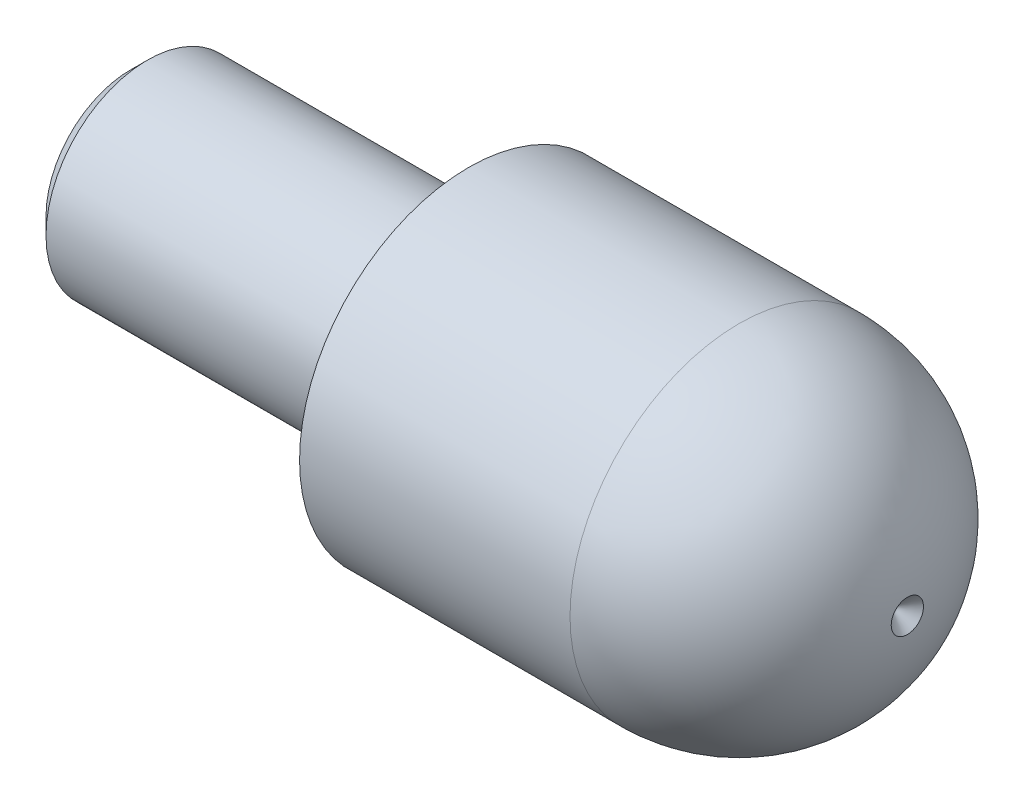
ISO-10303-21;
HEADER;
FILE_DESCRIPTION(('STEP AP214'),'2;1');
FILE_NAME('part.step','',(''),(''),'','','');
FILE_SCHEMA(('AUTOMOTIVE_DESIGN { 1 0 10303 214 1 1 1 1 }'));
ENDSEC;
DATA;
#1=APPLICATION_CONTEXT('core data for automotive mechanical design processes');
#2=APPLICATION_PROTOCOL_DEFINITION('international standard','automotive_design',2000,#1);
#3=PRODUCT_CONTEXT('',#1,'mechanical');
#4=PRODUCT('Part','Part','',(#3));
#5=PRODUCT_RELATED_PRODUCT_CATEGORY('part','',(#4));
#6=PRODUCT_DEFINITION_FORMATION('','',#4);
#7=PRODUCT_DEFINITION_CONTEXT('part definition',#1,'design');
#8=PRODUCT_DEFINITION('design','',#6,#7);
#9=PRODUCT_DEFINITION_SHAPE('','',#8);
#10=(LENGTH_UNIT() NAMED_UNIT(*) SI_UNIT(.MILLI.,.METRE.));
#11=(NAMED_UNIT(*) PLANE_ANGLE_UNIT() SI_UNIT($,.RADIAN.));
#12=(NAMED_UNIT(*) SI_UNIT($,.STERADIAN.) SOLID_ANGLE_UNIT());
#13=UNCERTAINTY_MEASURE_WITH_UNIT(LENGTH_MEASURE(1.E-05),#10,'distance_accuracy_value','');
#14=(GEOMETRIC_REPRESENTATION_CONTEXT(3) GLOBAL_UNCERTAINTY_ASSIGNED_CONTEXT((#13)) GLOBAL_UNIT_ASSIGNED_CONTEXT((#10,
#11,#12)) REPRESENTATION_CONTEXT('',''));
#15=CARTESIAN_POINT('',(0.,0.,0.));
#16=DIRECTION('',(0.,0.,1.));
#17=DIRECTION('',(1.,0.,0.));
#18=AXIS2_PLACEMENT_3D('',#15,#16,#17);
#19=CARTESIAN_POINT('',(-9.7295,0.,0.));
#20=DIRECTION('',(-1.,0.,0.));
#21=DIRECTION('',(0.,0.,1.));
#22=AXIS2_PLACEMENT_3D('',#19,#20,#21);
#23=CONICAL_SURFACE('',#22,1.2295,0.785398163397449);
#24=CARTESIAN_POINT('',(-10.,0.,0.));
#25=DIRECTION('',(-1.,0.,0.));
#26=DIRECTION('',(0.,0.,1.));
#27=AXIS2_PLACEMENT_3D('',#24,#25,#26);
#28=CIRCLE('',#27,1.5);
#29=CARTESIAN_POINT('',(-10.,0.,1.5));
#30=VERTEX_POINT('',#29);
#31=EDGE_CURVE('E70',#30,#30,#28,.T.);
#32=ORIENTED_EDGE('',*,*,#31,.T.);
#33=EDGE_LOOP('',(#32));
#34=FACE_BOUND('',#33,.T.);
#35=CARTESIAN_POINT('',(-9.8,0.,0.));
#36=DIRECTION('',(-1.,0.,0.));
#37=DIRECTION('',(0.,0.,1.));
#38=AXIS2_PLACEMENT_3D('',#35,#36,#37);
#39=CIRCLE('',#38,1.3);
#40=CARTESIAN_POINT('',(-9.8,0.,1.3));
#41=VERTEX_POINT('',#40);
#42=EDGE_CURVE('E35',#41,#41,#39,.F.);
#43=ORIENTED_EDGE('',*,*,#42,.T.);
#44=EDGE_LOOP('',(#43));
#45=FACE_BOUND('',#44,.T.);
#46=ADVANCED_FACE('F31',(#34,#45),#23,.F.);
#47=CARTESIAN_POINT('',(0.1,0.,0.));
#48=DIRECTION('',(-1.,0.,0.));
#49=DIRECTION('',(0.,0.,1.));
#50=AXIS2_PLACEMENT_3D('',#47,#48,#49);
#51=CYLINDRICAL_SURFACE('',#50,3.);
#52=CARTESIAN_POINT('',(-9.5,0.,0.));
#53=DIRECTION('',(-1.,0.,0.));
#54=DIRECTION('',(0.,0.,1.));
#55=AXIS2_PLACEMENT_3D('',#52,#53,#54);
#56=CIRCLE('',#55,3.);
#57=CARTESIAN_POINT('',(-9.5,0.,3.));
#58=VERTEX_POINT('',#57);
#59=EDGE_CURVE('E40',#58,#58,#56,.T.);
#60=ORIENTED_EDGE('',*,*,#59,.F.);
#61=EDGE_LOOP('',(#60));
#62=FACE_BOUND('',#61,.T.);
#63=CARTESIAN_POINT('',(-1.,0.,0.));
#64=DIRECTION('',(-1.,0.,0.));
#65=DIRECTION('',(0.,0.,1.));
#66=AXIS2_PLACEMENT_3D('',#63,#64,#65);
#67=CIRCLE('',#66,3.);
#68=CARTESIAN_POINT('',(-1.,0.,3.));
#69=VERTEX_POINT('',#68);
#70=EDGE_CURVE('E57',#69,#69,#67,.T.);
#71=ORIENTED_EDGE('',*,*,#70,.T.);
#72=EDGE_LOOP('',(#71));
#73=FACE_BOUND('',#72,.T.);
#74=ADVANCED_FACE('F87',(#62,#73),#51,.T.);
#75=CARTESIAN_POINT('',(-10.,0.6,0.));
#76=DIRECTION('',(1.,0.,0.));
#77=DIRECTION('',(0.,0.,-1.));
#78=AXIS2_PLACEMENT_3D('',#75,#76,#77);
#79=PLANE('',#78);
#80=CARTESIAN_POINT('',(-10.,0.,0.));
#81=DIRECTION('',(-1.,0.,0.));
#82=DIRECTION('',(0.,0.,1.));
#83=AXIS2_PLACEMENT_3D('',#80,#81,#82);
#84=CIRCLE('',#83,2.5);
#85=CARTESIAN_POINT('',(-10.,0.,2.5));
#86=VERTEX_POINT('',#85);
#87=EDGE_CURVE('E11',#86,#86,#84,.T.);
#88=ORIENTED_EDGE('',*,*,#87,.T.);
#89=EDGE_LOOP('',(#88));
#90=FACE_BOUND('',#89,.T.);
#91=ORIENTED_EDGE('',*,*,#31,.F.);
#92=EDGE_LOOP('',(#91));
#93=FACE_BOUND('',#92,.T.);
#94=ADVANCED_FACE('F33',(#90,#93),#79,.F.);
#95=CARTESIAN_POINT('',(-9.5,0.,0.));
#96=DIRECTION('',(1.,0.,0.));
#97=DIRECTION('',(0.,0.,-1.));
#98=AXIS2_PLACEMENT_3D('',#95,#96,#97);
#99=CONICAL_SURFACE('',#98,3.,0.785398163397448);
#100=ORIENTED_EDGE('',*,*,#87,.F.);
#101=EDGE_LOOP('',(#100));
#102=FACE_BOUND('',#101,.T.);
#103=ORIENTED_EDGE('',*,*,#59,.T.);
#104=EDGE_LOOP('',(#103));
#105=FACE_BOUND('',#104,.T.);
#106=ADVANCED_FACE('F85',(#102,#105),#99,.T.);
#107=CARTESIAN_POINT('',(-0.826794919243148,0.,0.));
#108=DIRECTION('',(-1.,0.,0.));
#109=DIRECTION('',(0.,0.,1.));
#110=AXIS2_PLACEMENT_3D('',#107,#108,#109);
#111=TOROIDAL_SURFACE('',#110,3.09999999999994,0.199999999999939);
#112=CARTESIAN_POINT('',(-0.82679491924312,0.,0.));
#113=DIRECTION('',(-1.,0.,0.));
#114=DIRECTION('',(0.,0.,1.));
#115=AXIS2_PLACEMENT_3D('',#112,#113,#114);
#116=CIRCLE('',#115,2.9);
#117=CARTESIAN_POINT('',(-0.82679491924312,0.,2.9));
#118=VERTEX_POINT('',#117);
#119=EDGE_CURVE('E67',#118,#118,#116,.T.);
#120=ORIENTED_EDGE('',*,*,#119,.T.);
#121=EDGE_LOOP('',(#120));
#122=FACE_BOUND('',#121,.T.);
#123=ORIENTED_EDGE('',*,*,#70,.F.);
#124=EDGE_LOOP('',(#123));
#125=FACE_BOUND('',#124,.T.);
#126=ADVANCED_FACE('F93',(#122,#125),#111,.F.);
#127=CARTESIAN_POINT('',(0.,0.,0.));
#128=DIRECTION('',(-1.,0.,0.));
#129=DIRECTION('',(0.,0.,1.));
#130=AXIS2_PLACEMENT_3D('',#127,#128,#129);
#131=CYLINDRICAL_SURFACE('',#130,2.9);
#132=CARTESIAN_POINT('',(-0.17320508075688,0.,0.));
#133=DIRECTION('',(-1.,0.,0.));
#134=DIRECTION('',(0.,0.,1.));
#135=AXIS2_PLACEMENT_3D('',#132,#133,#134);
#136=CIRCLE('',#135,2.9);
#137=CARTESIAN_POINT('',(-0.17320508075688,0.,2.9));
#138=VERTEX_POINT('',#137);
#139=EDGE_CURVE('E64',#138,#138,#136,.T.);
#140=ORIENTED_EDGE('',*,*,#139,.T.);
#141=EDGE_LOOP('',(#140));
#142=FACE_BOUND('',#141,.T.);
#143=ORIENTED_EDGE('',*,*,#119,.F.);
#144=EDGE_LOOP('',(#143));
#145=FACE_BOUND('',#144,.T.);
#146=ADVANCED_FACE('F95',(#142,#145),#131,.T.);
#147=CARTESIAN_POINT('',(-0.173205080756848,0.,0.));
#148=DIRECTION('',(-1.,0.,0.));
#149=DIRECTION('',(0.,0.,1.));
#150=AXIS2_PLACEMENT_3D('',#147,#148,#149);
#151=TOROIDAL_SURFACE('',#150,3.09999999999993,0.199999999999931);
#152=CARTESIAN_POINT('',(0.,0.,0.));
#153=DIRECTION('',(-1.,0.,0.));
#154=DIRECTION('',(0.,0.,1.));
#155=AXIS2_PLACEMENT_3D('',#152,#153,#154);
#156=CIRCLE('',#155,3.);
#157=CARTESIAN_POINT('',(0.,0.,3.));
#158=VERTEX_POINT('',#157);
#159=EDGE_CURVE('E61',#158,#158,#156,.T.);
#160=ORIENTED_EDGE('',*,*,#159,.T.);
#161=EDGE_LOOP('',(#160));
#162=FACE_BOUND('',#161,.T.);
#163=ORIENTED_EDGE('',*,*,#139,.F.);
#164=EDGE_LOOP('',(#163));
#165=FACE_BOUND('',#164,.T.);
#166=ADVANCED_FACE('F102',(#162,#165),#151,.F.);
#167=CARTESIAN_POINT('',(12.5,0.,0.));
#168=DIRECTION('',(1.,0.,0.));
#169=DIRECTION('',(0.,0.,-1.));
#170=AXIS2_PLACEMENT_3D('',#167,#168,#169);
#171=CONICAL_SURFACE('',#170,0.,0.785398163397377);
#172=CARTESIAN_POINT('',(12.977178028659,0.,0.));
#173=DIRECTION('',(-1.,0.,0.));
#174=DIRECTION('',(0.,0.,1.));
#175=AXIS2_PLACEMENT_3D('',#172,#173,#174);
#176=CIRCLE('',#175,0.477178028658931);
#177=CARTESIAN_POINT('',(12.977178028659,0.,0.477178028658931));
#178=VERTEX_POINT('',#177);
#179=EDGE_CURVE('E73',#178,#178,#176,.T.);
#180=ORIENTED_EDGE('',*,*,#179,.F.);
#181=EDGE_LOOP('',(#180));
#182=FACE_BOUND('',#181,.T.);
#183=CARTESIAN_POINT('',(12.5,0.,0.));
#184=VERTEX_POINT('',#183);
#185=VERTEX_LOOP('',#184);
#186=FACE_BOUND('',#185,.T.);
#187=ADVANCED_FACE('F113',(#182,#186),#171,.F.);
#188=CARTESIAN_POINT('',(7.99999999999976,-3.40439482160448E-13,0.));
#189=DIRECTION('',(-1.,0.,0.));
#190=DIRECTION('',(0.,1.,0.));
#191=AXIS2_PLACEMENT_3D('',#188,#189,#190);
#192=SPHERICAL_SURFACE('',#191,5.00000000000034);
#193=CARTESIAN_POINT('',(8.,0.,0.));
#194=DIRECTION('',(-1.,0.,0.));
#195=DIRECTION('',(0.,0.,1.));
#196=AXIS2_PLACEMENT_3D('',#193,#194,#195);
#197=CIRCLE('',#196,5.);
#198=CARTESIAN_POINT('',(8.,0.,5.));
#199=VERTEX_POINT('',#198);
#200=EDGE_CURVE('E76',#199,#199,#197,.T.);
#201=ORIENTED_EDGE('',*,*,#200,.F.);
#202=EDGE_LOOP('',(#201));
#203=FACE_BOUND('',#202,.T.);
#204=ORIENTED_EDGE('',*,*,#179,.T.);
#205=EDGE_LOOP('',(#204));
#206=FACE_BOUND('',#205,.T.);
#207=ADVANCED_FACE('F116',(#203,#206),#192,.T.);
#208=CARTESIAN_POINT('',(12.5,0.,0.));
#209=DIRECTION('',(-1.,0.,0.));
#210=DIRECTION('',(0.,0.,1.));
#211=AXIS2_PLACEMENT_3D('',#208,#209,#210);
#212=CYLINDRICAL_SURFACE('',#211,5.);
#213=CARTESIAN_POINT('',(0.,0.,0.));
#214=DIRECTION('',(-1.,0.,0.));
#215=DIRECTION('',(0.,0.,1.));
#216=AXIS2_PLACEMENT_3D('',#213,#214,#215);
#217=CIRCLE('',#216,5.);
#218=CARTESIAN_POINT('',(0.,0.,5.));
#219=VERTEX_POINT('',#218);
#220=EDGE_CURVE('E79',#219,#219,#217,.T.);
#221=ORIENTED_EDGE('',*,*,#220,.F.);
#222=EDGE_LOOP('',(#221));
#223=FACE_BOUND('',#222,.T.);
#224=ORIENTED_EDGE('',*,*,#200,.T.);
#225=EDGE_LOOP('',(#224));
#226=FACE_BOUND('',#225,.T.);
#227=ADVANCED_FACE('F120',(#223,#226),#212,.T.);
#228=CARTESIAN_POINT('',(0.,0.,0.));
#229=DIRECTION('',(1.,0.,0.));
#230=DIRECTION('',(0.,0.,-1.));
#231=AXIS2_PLACEMENT_3D('',#228,#229,#230);
#232=PLANE('',#231);
#233=ORIENTED_EDGE('',*,*,#159,.F.);
#234=EDGE_LOOP('',(#233));
#235=FACE_BOUND('',#234,.T.);
#236=ORIENTED_EDGE('',*,*,#220,.T.);
#237=EDGE_LOOP('',(#236));
#238=FACE_BOUND('',#237,.T.);
#239=ADVANCED_FACE('F124',(#235,#238),#232,.F.);
#240=CARTESIAN_POINT('',(-0.5,0.,0.));
#241=DIRECTION('',(-1.,0.,0.));
#242=DIRECTION('',(0.,0.,1.));
#243=AXIS2_PLACEMENT_3D('',#240,#241,#242);
#244=CYLINDRICAL_SURFACE('',#243,1.3);
#245=ORIENTED_EDGE('',*,*,#42,.F.);
#246=EDGE_LOOP('',(#245));
#247=FACE_BOUND('',#246,.T.);
#248=CARTESIAN_POINT('',(-1.2505553499465,0.,0.));
#249=DIRECTION('',(-1.,0.,0.));
#250=DIRECTION('',(0.,0.,1.));
#251=AXIS2_PLACEMENT_3D('',#248,#249,#250);
#252=CIRCLE('',#251,1.3);
#253=CARTESIAN_POINT('',(-1.2505553499465,0.,1.3));
#254=VERTEX_POINT('',#253);
#255=EDGE_CURVE('E53',#254,#254,#252,.T.);
#256=ORIENTED_EDGE('',*,*,#255,.F.);
#257=EDGE_LOOP('',(#256));
#258=FACE_BOUND('',#257,.T.);
#259=ADVANCED_FACE('F49',(#247,#258),#244,.F.);
#260=CARTESIAN_POINT('',(-0.5,0.,0.));
#261=DIRECTION('',(-1.,0.,0.));
#262=DIRECTION('',(0.,0.,1.));
#263=AXIS2_PLACEMENT_3D('',#260,#261,#262);
#264=CONICAL_SURFACE('',#263,0.,1.04719755119663);
#265=CARTESIAN_POINT('',(-0.5,0.,0.));
#266=VERTEX_POINT('',#265);
#267=VERTEX_LOOP('',#266);
#268=FACE_BOUND('',#267,.T.);
#269=ORIENTED_EDGE('',*,*,#255,.T.);
#270=EDGE_LOOP('',(#269));
#271=FACE_BOUND('',#270,.T.);
#272=ADVANCED_FACE('F46',(#268,#271),#264,.F.);
#273=CLOSED_SHELL('',(#46,#74,#94,#106,#126,#146,#166,#187,#207,#227,#239,#259,#272));
#274=MANIFOLD_SOLID_BREP('B2',#273);
#275=ADVANCED_BREP_SHAPE_REPRESENTATION('',(#18,#274),#14);
#276=SHAPE_DEFINITION_REPRESENTATION(#9,#275);
ENDSEC;
END-ISO-10303-21;
